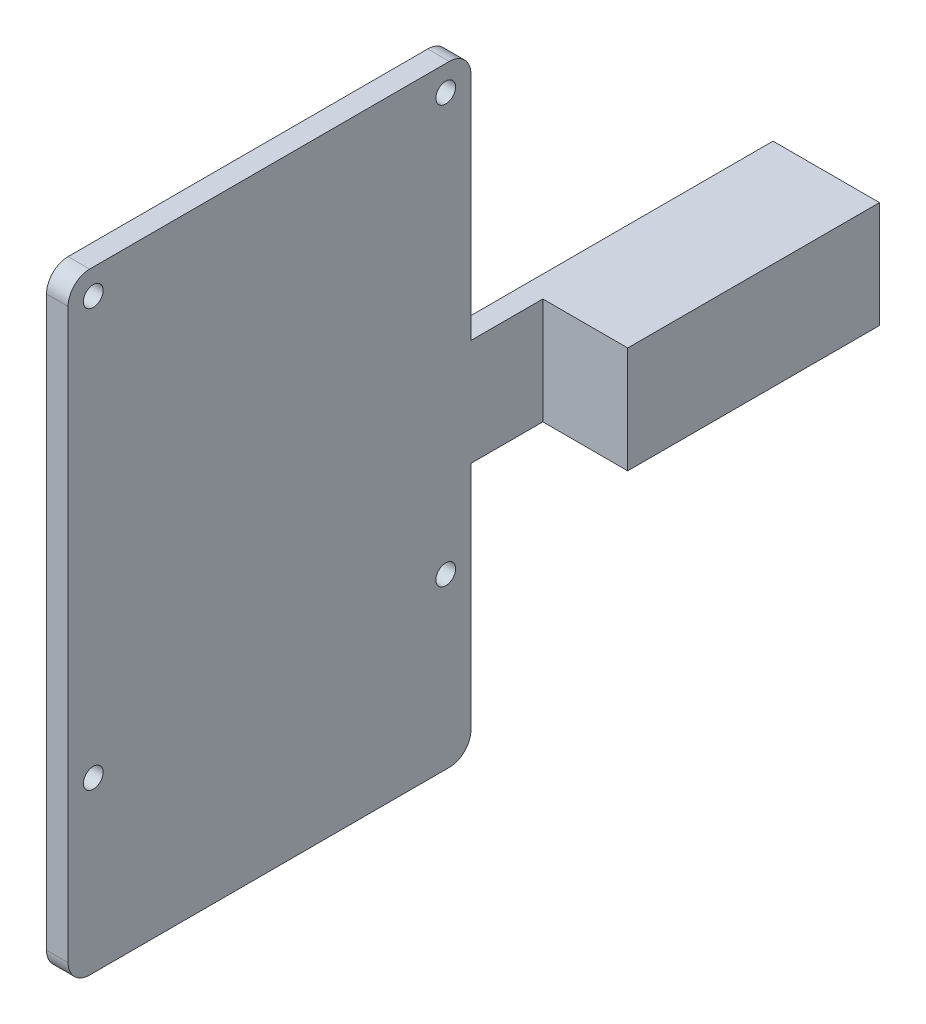
ISO-10303-21;
HEADER;
FILE_DESCRIPTION(('STEP AP214'),'2;1');
FILE_NAME('part.step','',(''),(''),'','','');
FILE_SCHEMA(('AUTOMOTIVE_DESIGN { 1 0 10303 214 1 1 1 1 }'));
ENDSEC;
DATA;
#1=APPLICATION_CONTEXT('core data for automotive mechanical design processes');
#2=APPLICATION_PROTOCOL_DEFINITION('international standard','automotive_design',2000,#1);
#3=PRODUCT_CONTEXT('',#1,'mechanical');
#4=PRODUCT('Part','Part','',(#3));
#5=PRODUCT_RELATED_PRODUCT_CATEGORY('part','',(#4));
#6=PRODUCT_DEFINITION_FORMATION('','',#4);
#7=PRODUCT_DEFINITION_CONTEXT('part definition',#1,'design');
#8=PRODUCT_DEFINITION('design','',#6,#7);
#9=PRODUCT_DEFINITION_SHAPE('','',#8);
#10=(LENGTH_UNIT() NAMED_UNIT(*) SI_UNIT(.MILLI.,.METRE.));
#11=(NAMED_UNIT(*) PLANE_ANGLE_UNIT() SI_UNIT($,.RADIAN.));
#12=(NAMED_UNIT(*) SI_UNIT($,.STERADIAN.) SOLID_ANGLE_UNIT());
#13=UNCERTAINTY_MEASURE_WITH_UNIT(LENGTH_MEASURE(1.E-05),#10,'distance_accuracy_value','');
#14=(GEOMETRIC_REPRESENTATION_CONTEXT(3) GLOBAL_UNCERTAINTY_ASSIGNED_CONTEXT((#13)) GLOBAL_UNIT_ASSIGNED_CONTEXT((#10,
#11,#12)) REPRESENTATION_CONTEXT('',''));
#15=CARTESIAN_POINT('',(0.,0.,0.));
#16=DIRECTION('',(0.,0.,1.));
#17=DIRECTION('',(1.,0.,0.));
#18=AXIS2_PLACEMENT_3D('',#15,#16,#17);
#19=CARTESIAN_POINT('',(-7.4,-7.4,35.));
#20=DIRECTION('',(1.,0.,0.));
#21=DIRECTION('',(0.,0.,-1.));
#22=AXIS2_PLACEMENT_3D('',#19,#20,#21);
#23=PLANE('',#22);
#24=CARTESIAN_POINT('',(-7.4,-19.,97.5));
#25=DIRECTION('',(1.,0.,0.));
#26=DIRECTION('',(0.,0.,-1.));
#27=AXIS2_PLACEMENT_3D('',#24,#25,#26);
#28=CIRCLE('',#27,1.375);
#29=CARTESIAN_POINT('',(-7.4,-19.,96.125));
#30=VERTEX_POINT('',#29);
#31=EDGE_CURVE('E340',#30,#30,#28,.T.);
#32=ORIENTED_EDGE('',*,*,#31,.T.);
#33=EDGE_LOOP('',(#32));
#34=FACE_BOUND('',#33,.T.);
#35=CARTESIAN_POINT('',(-7.4,-19.,48.5));
#36=DIRECTION('',(1.,0.,0.));
#37=DIRECTION('',(0.,0.,-1.));
#38=AXIS2_PLACEMENT_3D('',#35,#36,#37);
#39=CIRCLE('',#38,1.375);
#40=CARTESIAN_POINT('',(-7.4,-19.,47.125));
#41=VERTEX_POINT('',#40);
#42=EDGE_CURVE('E341',#41,#41,#39,.T.);
#43=ORIENTED_EDGE('',*,*,#42,.T.);
#44=EDGE_LOOP('',(#43));
#45=FACE_BOUND('',#44,.T.);
#46=CARTESIAN_POINT('',(-7.4,39.,48.5));
#47=DIRECTION('',(1.,0.,0.));
#48=DIRECTION('',(0.,0.,-1.));
#49=AXIS2_PLACEMENT_3D('',#46,#47,#48);
#50=CIRCLE('',#49,1.375);
#51=CARTESIAN_POINT('',(-7.4,39.,47.125));
#52=VERTEX_POINT('',#51);
#53=EDGE_CURVE('E346',#52,#52,#50,.T.);
#54=ORIENTED_EDGE('',*,*,#53,.T.);
#55=EDGE_LOOP('',(#54));
#56=FACE_BOUND('',#55,.T.);
#57=CARTESIAN_POINT('',(-7.4,39.,97.5));
#58=DIRECTION('',(1.,0.,0.));
#59=DIRECTION('',(0.,0.,-1.));
#60=AXIS2_PLACEMENT_3D('',#57,#58,#59);
#61=CIRCLE('',#60,1.375);
#62=CARTESIAN_POINT('',(-7.4,39.,96.125));
#63=VERTEX_POINT('',#62);
#64=EDGE_CURVE('E349',#63,#63,#61,.T.);
#65=ORIENTED_EDGE('',*,*,#64,.T.);
#66=EDGE_LOOP('',(#65));
#67=FACE_BOUND('',#66,.T.);
#68=DIRECTION('',(0.,-1.,0.));
#69=VECTOR('',#68,1.);
#70=CARTESIAN_POINT('',(-7.4,-42.5,45.));
#71=LINE('',#70,#69);
#72=CARTESIAN_POINT('',(-7.4,-7.4,45.));
#73=VERTEX_POINT('',#72);
#74=CARTESIAN_POINT('',(-7.4,-39.5,45.));
#75=VERTEX_POINT('',#74);
#76=EDGE_CURVE('E140',#73,#75,#71,.T.);
#77=ORIENTED_EDGE('',*,*,#76,.T.);
#78=CARTESIAN_POINT('',(-7.4,-39.5,48.));
#79=DIRECTION('',(1.,0.,0.));
#80=DIRECTION('',(0.,0.,-1.));
#81=AXIS2_PLACEMENT_3D('',#78,#79,#80);
#82=CIRCLE('',#81,3.);
#83=CARTESIAN_POINT('',(-7.4,-42.5,48.));
#84=VERTEX_POINT('',#83);
#85=EDGE_CURVE('E210',#75,#84,#82,.F.);
#86=ORIENTED_EDGE('',*,*,#85,.T.);
#87=DIRECTION('',(0.,0.,-1.));
#88=VECTOR('',#87,1.);
#89=CARTESIAN_POINT('',(-7.4,-42.5,101.));
#90=LINE('',#89,#88);
#91=CARTESIAN_POINT('',(-7.4,-42.5,98.));
#92=VERTEX_POINT('',#91);
#93=EDGE_CURVE('E167',#92,#84,#90,.T.);
#94=ORIENTED_EDGE('',*,*,#93,.F.);
#95=CARTESIAN_POINT('',(-7.4,-39.5,98.));
#96=DIRECTION('',(1.,0.,0.));
#97=DIRECTION('',(0.,0.,-1.));
#98=AXIS2_PLACEMENT_3D('',#95,#96,#97);
#99=CIRCLE('',#98,3.);
#100=CARTESIAN_POINT('',(-7.4,-39.5,101.));
#101=VERTEX_POINT('',#100);
#102=EDGE_CURVE('E208',#92,#101,#99,.F.);
#103=ORIENTED_EDGE('',*,*,#102,.T.);
#104=DIRECTION('',(0.,-1.,0.));
#105=VECTOR('',#104,1.);
#106=CARTESIAN_POINT('',(-7.4,-42.5,101.));
#107=LINE('',#106,#105);
#108=CARTESIAN_POINT('',(-7.40000000000001,39.5,101.));
#109=VERTEX_POINT('',#108);
#110=EDGE_CURVE('E234',#109,#101,#107,.T.);
#111=ORIENTED_EDGE('',*,*,#110,.F.);
#112=CARTESIAN_POINT('',(-7.4,39.5,98.));
#113=DIRECTION('',(1.,0.,0.));
#114=DIRECTION('',(0.,0.,-1.));
#115=AXIS2_PLACEMENT_3D('',#112,#113,#114);
#116=CIRCLE('',#115,3.);
#117=CARTESIAN_POINT('',(-7.40000000000001,42.5,98.));
#118=VERTEX_POINT('',#117);
#119=EDGE_CURVE('E205',#109,#118,#116,.F.);
#120=ORIENTED_EDGE('',*,*,#119,.T.);
#121=DIRECTION('',(0.,0.,-1.));
#122=VECTOR('',#121,1.);
#123=CARTESIAN_POINT('',(-7.40000000000001,42.5,101.));
#124=LINE('',#123,#122);
#125=CARTESIAN_POINT('',(-7.40000000000001,42.5,48.));
#126=VERTEX_POINT('',#125);
#127=EDGE_CURVE('E223',#118,#126,#124,.T.);
#128=ORIENTED_EDGE('',*,*,#127,.T.);
#129=CARTESIAN_POINT('',(-7.4,39.5,48.));
#130=DIRECTION('',(1.,0.,0.));
#131=DIRECTION('',(0.,0.,-1.));
#132=AXIS2_PLACEMENT_3D('',#129,#130,#131);
#133=CIRCLE('',#132,3.);
#134=CARTESIAN_POINT('',(-7.40000000000001,39.5,45.));
#135=VERTEX_POINT('',#134);
#136=EDGE_CURVE('E48',#126,#135,#133,.F.);
#137=ORIENTED_EDGE('',*,*,#136,.T.);
#138=CARTESIAN_POINT('',(-7.40000000000001,7.4,45.));
#139=VERTEX_POINT('',#138);
#140=EDGE_CURVE('E131',#135,#139,#71,.T.);
#141=ORIENTED_EDGE('',*,*,#140,.T.);
#142=DIRECTION('',(0.,0.,-1.));
#143=VECTOR('',#142,1.);
#144=CARTESIAN_POINT('',(-7.4,7.4,35.));
#145=LINE('',#144,#143);
#146=CARTESIAN_POINT('',(-7.4,7.4,0.));
#147=VERTEX_POINT('',#146);
#148=EDGE_CURVE('E135',#139,#147,#145,.T.);
#149=ORIENTED_EDGE('',*,*,#148,.T.);
#150=DIRECTION('',(0.,-1.,0.));
#151=VECTOR('',#150,1.);
#152=CARTESIAN_POINT('',(-7.4,-7.4,0.));
#153=LINE('',#152,#151);
#154=CARTESIAN_POINT('',(-7.4,-7.4,0.));
#155=VERTEX_POINT('',#154);
#156=EDGE_CURVE('E171',#147,#155,#153,.T.);
#157=ORIENTED_EDGE('',*,*,#156,.T.);
#158=DIRECTION('',(0.,0.,-1.));
#159=VECTOR('',#158,1.);
#160=CARTESIAN_POINT('',(-7.4,-7.4,35.));
#161=LINE('',#160,#159);
#162=EDGE_CURVE('E187',#73,#155,#161,.T.);
#163=ORIENTED_EDGE('',*,*,#162,.F.);
#164=EDGE_LOOP('',(#77,#86,#94,#103,#111,#120,#128,#137,#141,#149,#157,#163));
#165=FACE_BOUND('',#164,.T.);
#166=ADVANCED_FACE('F33',(#34,#45,#56,#67,#165),#23,.F.);
#167=CARTESIAN_POINT('',(7.4,-7.4,35.));
#168=DIRECTION('',(0.,1.,0.));
#169=DIRECTION('',(-1.,0.,0.));
#170=AXIS2_PLACEMENT_3D('',#167,#168,#169);
#171=PLANE('',#170);
#172=DIRECTION('',(1.,0.,0.));
#173=VECTOR('',#172,1.);
#174=CARTESIAN_POINT('',(7.4,-7.4,0.));
#175=LINE('',#174,#173);
#176=CARTESIAN_POINT('',(7.4,-7.4,0.));
#177=VERTEX_POINT('',#176);
#178=EDGE_CURVE('E178',#155,#177,#175,.T.);
#179=ORIENTED_EDGE('',*,*,#178,.T.);
#180=DIRECTION('',(0.,0.,-1.));
#181=VECTOR('',#180,1.);
#182=CARTESIAN_POINT('',(7.4,-7.4,35.));
#183=LINE('',#182,#181);
#184=CARTESIAN_POINT('',(7.4,-7.4,35.));
#185=VERTEX_POINT('',#184);
#186=EDGE_CURVE('E184',#185,#177,#183,.T.);
#187=ORIENTED_EDGE('',*,*,#186,.F.);
#188=DIRECTION('',(1.,0.,0.));
#189=VECTOR('',#188,1.);
#190=CARTESIAN_POINT('',(7.4,-7.4,35.));
#191=LINE('',#190,#189);
#192=CARTESIAN_POINT('',(-4.4,-7.4,35.));
#193=VERTEX_POINT('',#192);
#194=EDGE_CURVE('E172',#193,#185,#191,.T.);
#195=ORIENTED_EDGE('',*,*,#194,.F.);
#196=DIRECTION('',(0.,0.,-1.));
#197=VECTOR('',#196,1.);
#198=CARTESIAN_POINT('',(-4.4,-7.4,45.));
#199=LINE('',#198,#197);
#200=CARTESIAN_POINT('',(-4.4,-7.4,45.));
#201=VERTEX_POINT('',#200);
#202=EDGE_CURVE('E159',#201,#193,#199,.T.);
#203=ORIENTED_EDGE('',*,*,#202,.F.);
#204=DIRECTION('',(1.,0.,0.));
#205=VECTOR('',#204,1.);
#206=CARTESIAN_POINT('',(-7.4,-7.4,45.));
#207=LINE('',#206,#205);
#208=EDGE_CURVE('E157',#73,#201,#207,.T.);
#209=ORIENTED_EDGE('',*,*,#208,.F.);
#210=ORIENTED_EDGE('',*,*,#162,.T.);
#211=EDGE_LOOP('',(#179,#187,#195,#203,#209,#210));
#212=FACE_BOUND('',#211,.T.);
#213=ADVANCED_FACE('F273',(#212),#171,.F.);
#214=CARTESIAN_POINT('',(7.4,-7.4,35.));
#215=DIRECTION('',(-1.,0.,0.));
#216=DIRECTION('',(0.,0.,1.));
#217=AXIS2_PLACEMENT_3D('',#214,#215,#216);
#218=PLANE('',#217);
#219=DIRECTION('',(0.,1.,0.));
#220=VECTOR('',#219,1.);
#221=CARTESIAN_POINT('',(7.4,-7.4,0.));
#222=LINE('',#221,#220);
#223=CARTESIAN_POINT('',(7.4,7.4,0.));
#224=VERTEX_POINT('',#223);
#225=EDGE_CURVE('E180',#177,#224,#222,.T.);
#226=ORIENTED_EDGE('',*,*,#225,.T.);
#227=DIRECTION('',(0.,0.,-1.));
#228=VECTOR('',#227,1.);
#229=CARTESIAN_POINT('',(7.4,7.4,35.));
#230=LINE('',#229,#228);
#231=CARTESIAN_POINT('',(7.4,7.4,35.));
#232=VERTEX_POINT('',#231);
#233=EDGE_CURVE('E151',#232,#224,#230,.T.);
#234=ORIENTED_EDGE('',*,*,#233,.F.);
#235=DIRECTION('',(0.,1.,0.));
#236=VECTOR('',#235,1.);
#237=CARTESIAN_POINT('',(7.4,-7.4,35.));
#238=LINE('',#237,#236);
#239=EDGE_CURVE('E174',#185,#232,#238,.T.);
#240=ORIENTED_EDGE('',*,*,#239,.F.);
#241=ORIENTED_EDGE('',*,*,#186,.T.);
#242=EDGE_LOOP('',(#226,#234,#240,#241));
#243=FACE_BOUND('',#242,.T.);
#244=ADVANCED_FACE('F279',(#243),#218,.F.);
#245=CARTESIAN_POINT('',(7.4,7.4,35.));
#246=DIRECTION('',(0.,-1.,0.));
#247=DIRECTION('',(1.,0.,0.));
#248=AXIS2_PLACEMENT_3D('',#245,#246,#247);
#249=PLANE('',#248);
#250=DIRECTION('',(-1.,0.,0.));
#251=VECTOR('',#250,1.);
#252=CARTESIAN_POINT('',(7.4,7.4,0.));
#253=LINE('',#252,#251);
#254=EDGE_CURVE('E150',#224,#147,#253,.T.);
#255=ORIENTED_EDGE('',*,*,#254,.T.);
#256=ORIENTED_EDGE('',*,*,#148,.F.);
#257=DIRECTION('',(-1.,0.,0.));
#258=VECTOR('',#257,1.);
#259=CARTESIAN_POINT('',(-7.4,7.4,45.));
#260=LINE('',#259,#258);
#261=CARTESIAN_POINT('',(-4.4,7.4,45.));
#262=VERTEX_POINT('',#261);
#263=EDGE_CURVE('E146',#262,#139,#260,.T.);
#264=ORIENTED_EDGE('',*,*,#263,.F.);
#265=DIRECTION('',(0.,0.,-1.));
#266=VECTOR('',#265,1.);
#267=CARTESIAN_POINT('',(-4.4,7.4,45.));
#268=LINE('',#267,#266);
#269=CARTESIAN_POINT('',(-4.4,7.4,35.));
#270=VERTEX_POINT('',#269);
#271=EDGE_CURVE('E156',#262,#270,#268,.T.);
#272=ORIENTED_EDGE('',*,*,#271,.T.);
#273=DIRECTION('',(-1.,0.,0.));
#274=VECTOR('',#273,1.);
#275=CARTESIAN_POINT('',(7.4,7.4,35.));
#276=LINE('',#275,#274);
#277=EDGE_CURVE('E152',#232,#270,#276,.T.);
#278=ORIENTED_EDGE('',*,*,#277,.F.);
#279=ORIENTED_EDGE('',*,*,#233,.T.);
#280=EDGE_LOOP('',(#255,#256,#264,#272,#278,#279));
#281=FACE_BOUND('',#280,.T.);
#282=ADVANCED_FACE('F144',(#281),#249,.F.);
#283=CARTESIAN_POINT('',(0.,0.,35.));
#284=DIRECTION('',(0.,0.,1.));
#285=DIRECTION('',(1.,0.,0.));
#286=AXIS2_PLACEMENT_3D('',#283,#284,#285);
#287=PLANE('',#286);
#288=DIRECTION('',(0.,1.,0.));
#289=VECTOR('',#288,1.);
#290=CARTESIAN_POINT('',(-4.4,7.4,35.));
#291=LINE('',#290,#289);
#292=EDGE_CURVE('E162',#193,#270,#291,.T.);
#293=ORIENTED_EDGE('',*,*,#292,.F.);
#294=ORIENTED_EDGE('',*,*,#194,.T.);
#295=ORIENTED_EDGE('',*,*,#239,.T.);
#296=ORIENTED_EDGE('',*,*,#277,.T.);
#297=EDGE_LOOP('',(#293,#294,#295,#296));
#298=FACE_BOUND('',#297,.T.);
#299=ADVANCED_FACE('F322',(#298),#287,.T.);
#300=CARTESIAN_POINT('',(0.,0.,0.));
#301=DIRECTION('',(0.,0.,1.));
#302=DIRECTION('',(1.,0.,0.));
#303=AXIS2_PLACEMENT_3D('',#300,#301,#302);
#304=PLANE('',#303);
#305=ORIENTED_EDGE('',*,*,#156,.F.);
#306=ORIENTED_EDGE('',*,*,#254,.F.);
#307=ORIENTED_EDGE('',*,*,#225,.F.);
#308=ORIENTED_EDGE('',*,*,#178,.F.);
#309=EDGE_LOOP('',(#305,#306,#307,#308));
#310=FACE_BOUND('',#309,.T.);
#311=ADVANCED_FACE('F320',(#310),#304,.F.);
#312=CARTESIAN_POINT('',(-4.4,7.4,45.));
#313=DIRECTION('',(-1.,0.,0.));
#314=DIRECTION('',(0.,-1.,0.));
#315=AXIS2_PLACEMENT_3D('',#312,#313,#314);
#316=PLANE('',#315);
#317=CARTESIAN_POINT('',(-4.4,-19.,97.5));
#318=DIRECTION('',(1.,0.,0.));
#319=DIRECTION('',(0.,1.,0.));
#320=AXIS2_PLACEMENT_3D('',#317,#318,#319);
#321=CIRCLE('',#320,1.375);
#322=CARTESIAN_POINT('',(-4.4,-17.625,97.5));
#323=VERTEX_POINT('',#322);
#324=EDGE_CURVE('E356',#323,#323,#321,.T.);
#325=ORIENTED_EDGE('',*,*,#324,.F.);
#326=EDGE_LOOP('',(#325));
#327=FACE_BOUND('',#326,.T.);
#328=CARTESIAN_POINT('',(-4.4,-19.,48.5));
#329=DIRECTION('',(1.,0.,0.));
#330=DIRECTION('',(0.,1.,0.));
#331=AXIS2_PLACEMENT_3D('',#328,#329,#330);
#332=CIRCLE('',#331,1.375);
#333=CARTESIAN_POINT('',(-4.4,-17.625,48.5));
#334=VERTEX_POINT('',#333);
#335=EDGE_CURVE('E358',#334,#334,#332,.T.);
#336=ORIENTED_EDGE('',*,*,#335,.F.);
#337=EDGE_LOOP('',(#336));
#338=FACE_BOUND('',#337,.T.);
#339=CARTESIAN_POINT('',(-4.4,39.,48.5));
#340=DIRECTION('',(1.,0.,0.));
#341=DIRECTION('',(0.,1.,0.));
#342=AXIS2_PLACEMENT_3D('',#339,#340,#341);
#343=CIRCLE('',#342,1.375);
#344=CARTESIAN_POINT('',(-4.4,40.375,48.5));
#345=VERTEX_POINT('',#344);
#346=EDGE_CURVE('E355',#345,#345,#343,.T.);
#347=ORIENTED_EDGE('',*,*,#346,.F.);
#348=EDGE_LOOP('',(#347));
#349=FACE_BOUND('',#348,.T.);
#350=CARTESIAN_POINT('',(-4.4,39.,97.5));
#351=DIRECTION('',(1.,0.,0.));
#352=DIRECTION('',(0.,1.,0.));
#353=AXIS2_PLACEMENT_3D('',#350,#351,#352);
#354=CIRCLE('',#353,1.375);
#355=CARTESIAN_POINT('',(-4.4,40.375,97.5));
#356=VERTEX_POINT('',#355);
#357=EDGE_CURVE('E352',#356,#356,#354,.T.);
#358=ORIENTED_EDGE('',*,*,#357,.F.);
#359=EDGE_LOOP('',(#358));
#360=FACE_BOUND('',#359,.T.);
#361=DIRECTION('',(0.,0.,-1.));
#362=VECTOR('',#361,1.);
#363=CARTESIAN_POINT('',(-4.4,-42.5,101.));
#364=LINE('',#363,#362);
#365=CARTESIAN_POINT('',(-4.4,-42.5,98.));
#366=VERTEX_POINT('',#365);
#367=CARTESIAN_POINT('',(-4.4,-42.5,48.));
#368=VERTEX_POINT('',#367);
#369=EDGE_CURVE('E231',#366,#368,#364,.T.);
#370=ORIENTED_EDGE('',*,*,#369,.T.);
#371=CARTESIAN_POINT('',(-4.4,-39.5,48.));
#372=DIRECTION('',(-1.,0.,0.));
#373=DIRECTION('',(0.,-1.,0.));
#374=AXIS2_PLACEMENT_3D('',#371,#372,#373);
#375=CIRCLE('',#374,3.);
#376=CARTESIAN_POINT('',(-4.4,-39.5,45.));
#377=VERTEX_POINT('',#376);
#378=EDGE_CURVE('E201',#368,#377,#375,.F.);
#379=ORIENTED_EDGE('',*,*,#378,.T.);
#380=DIRECTION('',(0.,1.,0.));
#381=VECTOR('',#380,1.);
#382=CARTESIAN_POINT('',(-4.4,-42.5,45.));
#383=LINE('',#382,#381);
#384=EDGE_CURVE('E237',#377,#201,#383,.T.);
#385=ORIENTED_EDGE('',*,*,#384,.T.);
#386=ORIENTED_EDGE('',*,*,#202,.T.);
#387=ORIENTED_EDGE('',*,*,#292,.T.);
#388=ORIENTED_EDGE('',*,*,#271,.F.);
#389=CARTESIAN_POINT('',(-4.40000000000001,39.5,45.));
#390=VERTEX_POINT('',#389);
#391=EDGE_CURVE('E139',#262,#390,#383,.T.);
#392=ORIENTED_EDGE('',*,*,#391,.T.);
#393=CARTESIAN_POINT('',(-4.4,39.5,48.));
#394=DIRECTION('',(-1.,0.,0.));
#395=DIRECTION('',(0.,-1.,0.));
#396=AXIS2_PLACEMENT_3D('',#393,#394,#395);
#397=CIRCLE('',#396,3.);
#398=CARTESIAN_POINT('',(-4.40000000000001,42.5,48.));
#399=VERTEX_POINT('',#398);
#400=EDGE_CURVE('E197',#390,#399,#397,.F.);
#401=ORIENTED_EDGE('',*,*,#400,.T.);
#402=DIRECTION('',(0.,0.,-1.));
#403=VECTOR('',#402,1.);
#404=CARTESIAN_POINT('',(-4.40000000000001,42.5,101.));
#405=LINE('',#404,#403);
#406=CARTESIAN_POINT('',(-4.40000000000001,42.5,98.));
#407=VERTEX_POINT('',#406);
#408=EDGE_CURVE('E226',#407,#399,#405,.T.);
#409=ORIENTED_EDGE('',*,*,#408,.F.);
#410=CARTESIAN_POINT('',(-4.4,39.5,98.));
#411=DIRECTION('',(-1.,0.,0.));
#412=DIRECTION('',(0.,-1.,0.));
#413=AXIS2_PLACEMENT_3D('',#410,#411,#412);
#414=CIRCLE('',#413,3.);
#415=CARTESIAN_POINT('',(-4.40000000000001,39.5,101.));
#416=VERTEX_POINT('',#415);
#417=EDGE_CURVE('E195',#407,#416,#414,.F.);
#418=ORIENTED_EDGE('',*,*,#417,.T.);
#419=DIRECTION('',(0.,1.,0.));
#420=VECTOR('',#419,1.);
#421=CARTESIAN_POINT('',(-4.4,-42.5,101.));
#422=LINE('',#421,#420);
#423=CARTESIAN_POINT('',(-4.4,-39.5,101.));
#424=VERTEX_POINT('',#423);
#425=EDGE_CURVE('E229',#424,#416,#422,.T.);
#426=ORIENTED_EDGE('',*,*,#425,.F.);
#427=CARTESIAN_POINT('',(-4.4,-39.5,98.));
#428=DIRECTION('',(-1.,0.,0.));
#429=DIRECTION('',(0.,-1.,0.));
#430=AXIS2_PLACEMENT_3D('',#427,#428,#429);
#431=CIRCLE('',#430,3.);
#432=EDGE_CURVE('E199',#424,#366,#431,.F.);
#433=ORIENTED_EDGE('',*,*,#432,.T.);
#434=EDGE_LOOP('',(#370,#379,#385,#386,#387,#388,#392,#401,#409,#418,#426,#433));
#435=FACE_BOUND('',#434,.T.);
#436=ADVANCED_FACE('F254',(#327,#338,#349,#360,#435),#316,.F.);
#437=CARTESIAN_POINT('',(0.,0.,45.));
#438=DIRECTION('',(0.,0.,-1.));
#439=DIRECTION('',(-1.,0.,0.));
#440=AXIS2_PLACEMENT_3D('',#437,#438,#439);
#441=PLANE('',#440);
#442=ORIENTED_EDGE('',*,*,#384,.F.);
#443=DIRECTION('',(1.,0.,0.));
#444=VECTOR('',#443,1.);
#445=CARTESIAN_POINT('',(-7.4,-39.5,45.));
#446=LINE('',#445,#444);
#447=EDGE_CURVE('E203',#377,#75,#446,.F.);
#448=ORIENTED_EDGE('',*,*,#447,.T.);
#449=ORIENTED_EDGE('',*,*,#76,.F.);
#450=ORIENTED_EDGE('',*,*,#208,.T.);
#451=EDGE_LOOP('',(#442,#448,#449,#450));
#452=FACE_BOUND('',#451,.T.);
#453=ADVANCED_FACE('F257',(#452),#441,.T.);
#454=CARTESIAN_POINT('',(-7.4,-42.5,101.));
#455=DIRECTION('',(0.,1.,0.));
#456=DIRECTION('',(0.,0.,1.));
#457=AXIS2_PLACEMENT_3D('',#454,#455,#456);
#458=PLANE('',#457);
#459=ORIENTED_EDGE('',*,*,#93,.T.);
#460=DIRECTION('',(1.,0.,0.));
#461=VECTOR('',#460,1.);
#462=CARTESIAN_POINT('',(-4.4,-42.5,48.));
#463=LINE('',#462,#461);
#464=EDGE_CURVE('E192',#84,#368,#463,.T.);
#465=ORIENTED_EDGE('',*,*,#464,.T.);
#466=ORIENTED_EDGE('',*,*,#369,.F.);
#467=DIRECTION('',(1.,0.,0.));
#468=VECTOR('',#467,1.);
#469=CARTESIAN_POINT('',(-7.4,-42.5,98.));
#470=LINE('',#469,#468);
#471=EDGE_CURVE('E190',#366,#92,#470,.F.);
#472=ORIENTED_EDGE('',*,*,#471,.T.);
#473=EDGE_LOOP('',(#459,#465,#466,#472));
#474=FACE_BOUND('',#473,.T.);
#475=ADVANCED_FACE('F244',(#474),#458,.F.);
#476=CARTESIAN_POINT('',(-7.40000000000001,42.5,101.));
#477=DIRECTION('',(0.,-1.,0.));
#478=DIRECTION('',(0.,0.,-1.));
#479=AXIS2_PLACEMENT_3D('',#476,#477,#478);
#480=PLANE('',#479);
#481=ORIENTED_EDGE('',*,*,#408,.T.);
#482=DIRECTION('',(-1.,0.,0.));
#483=VECTOR('',#482,1.);
#484=CARTESIAN_POINT('',(-7.40000000000001,42.5,48.));
#485=LINE('',#484,#483);
#486=EDGE_CURVE('E41',#399,#126,#485,.T.);
#487=ORIENTED_EDGE('',*,*,#486,.T.);
#488=ORIENTED_EDGE('',*,*,#127,.F.);
#489=DIRECTION('',(-1.,0.,0.));
#490=VECTOR('',#489,1.);
#491=CARTESIAN_POINT('',(-7.40000000000001,42.5,98.));
#492=LINE('',#491,#490);
#493=EDGE_CURVE('E218',#118,#407,#492,.F.);
#494=ORIENTED_EDGE('',*,*,#493,.T.);
#495=EDGE_LOOP('',(#481,#487,#488,#494));
#496=FACE_BOUND('',#495,.T.);
#497=ADVANCED_FACE('F222',(#496),#480,.F.);
#498=CARTESIAN_POINT('',(0.,0.,101.));
#499=DIRECTION('',(0.,0.,-1.));
#500=DIRECTION('',(-1.,0.,0.));
#501=AXIS2_PLACEMENT_3D('',#498,#499,#500);
#502=PLANE('',#501);
#503=ORIENTED_EDGE('',*,*,#110,.T.);
#504=DIRECTION('',(1.,0.,0.));
#505=VECTOR('',#504,1.);
#506=CARTESIAN_POINT('',(0.,-39.5,101.));
#507=LINE('',#506,#505);
#508=EDGE_CURVE('E215',#101,#424,#507,.T.);
#509=ORIENTED_EDGE('',*,*,#508,.T.);
#510=ORIENTED_EDGE('',*,*,#425,.T.);
#511=DIRECTION('',(-1.,0.,0.));
#512=VECTOR('',#511,1.);
#513=CARTESIAN_POINT('',(0.,39.5,101.));
#514=LINE('',#513,#512);
#515=EDGE_CURVE('E212',#416,#109,#514,.T.);
#516=ORIENTED_EDGE('',*,*,#515,.T.);
#517=EDGE_LOOP('',(#503,#509,#510,#516));
#518=FACE_BOUND('',#517,.T.);
#519=ADVANCED_FACE('F308',(#518),#502,.F.);
#520=ORIENTED_EDGE('',*,*,#140,.F.);
#521=DIRECTION('',(-1.,0.,0.));
#522=VECTOR('',#521,1.);
#523=CARTESIAN_POINT('',(-4.40000000000001,39.5,45.));
#524=LINE('',#523,#522);
#525=EDGE_CURVE('E11',#135,#390,#524,.F.);
#526=ORIENTED_EDGE('',*,*,#525,.T.);
#527=ORIENTED_EDGE('',*,*,#391,.F.);
#528=ORIENTED_EDGE('',*,*,#263,.T.);
#529=EDGE_LOOP('',(#520,#526,#527,#528));
#530=FACE_BOUND('',#529,.T.);
#531=ADVANCED_FACE('F154',(#530),#441,.T.);
#532=CARTESIAN_POINT('',(-9.40000000000001,39.,97.5));
#533=DIRECTION('',(1.,0.,0.));
#534=DIRECTION('',(0.,1.,0.));
#535=AXIS2_PLACEMENT_3D('',#532,#533,#534);
#536=CYLINDRICAL_SURFACE('',#535,1.375);
#537=ORIENTED_EDGE('',*,*,#357,.T.);
#538=EDGE_LOOP('',(#537));
#539=FACE_BOUND('',#538,.T.);
#540=ORIENTED_EDGE('',*,*,#64,.F.);
#541=EDGE_LOOP('',(#540));
#542=FACE_BOUND('',#541,.T.);
#543=ADVANCED_FACE('F304',(#539,#542),#536,.F.);
#544=CARTESIAN_POINT('',(-9.40000000000001,39.,48.5));
#545=DIRECTION('',(1.,0.,0.));
#546=DIRECTION('',(0.,1.,0.));
#547=AXIS2_PLACEMENT_3D('',#544,#545,#546);
#548=CYLINDRICAL_SURFACE('',#547,1.375);
#549=ORIENTED_EDGE('',*,*,#346,.T.);
#550=EDGE_LOOP('',(#549));
#551=FACE_BOUND('',#550,.T.);
#552=ORIENTED_EDGE('',*,*,#53,.F.);
#553=EDGE_LOOP('',(#552));
#554=FACE_BOUND('',#553,.T.);
#555=ADVANCED_FACE('F297',(#551,#554),#548,.F.);
#556=CARTESIAN_POINT('',(-9.4,-19.,48.5));
#557=DIRECTION('',(1.,0.,0.));
#558=DIRECTION('',(0.,1.,0.));
#559=AXIS2_PLACEMENT_3D('',#556,#557,#558);
#560=CYLINDRICAL_SURFACE('',#559,1.375);
#561=ORIENTED_EDGE('',*,*,#335,.T.);
#562=EDGE_LOOP('',(#561));
#563=FACE_BOUND('',#562,.T.);
#564=ORIENTED_EDGE('',*,*,#42,.F.);
#565=EDGE_LOOP('',(#564));
#566=FACE_BOUND('',#565,.T.);
#567=ADVANCED_FACE('F291',(#563,#566),#560,.F.);
#568=CARTESIAN_POINT('',(-9.4,-19.,97.5));
#569=DIRECTION('',(1.,0.,0.));
#570=DIRECTION('',(0.,1.,0.));
#571=AXIS2_PLACEMENT_3D('',#568,#569,#570);
#572=CYLINDRICAL_SURFACE('',#571,1.375);
#573=ORIENTED_EDGE('',*,*,#324,.T.);
#574=EDGE_LOOP('',(#573));
#575=FACE_BOUND('',#574,.T.);
#576=ORIENTED_EDGE('',*,*,#31,.F.);
#577=EDGE_LOOP('',(#576));
#578=FACE_BOUND('',#577,.T.);
#579=ADVANCED_FACE('F287',(#575,#578),#572,.F.);
#580=CARTESIAN_POINT('',(-7.4,-39.5,48.));
#581=DIRECTION('',(-1.,0.,0.));
#582=DIRECTION('',(0.,0.,1.));
#583=AXIS2_PLACEMENT_3D('',#580,#581,#582);
#584=CYLINDRICAL_SURFACE('',#583,3.);
#585=ORIENTED_EDGE('',*,*,#85,.F.);
#586=ORIENTED_EDGE('',*,*,#447,.F.);
#587=ORIENTED_EDGE('',*,*,#378,.F.);
#588=ORIENTED_EDGE('',*,*,#464,.F.);
#589=EDGE_LOOP('',(#585,#586,#587,#588));
#590=FACE_BOUND('',#589,.T.);
#591=ADVANCED_FACE('F250',(#590),#584,.T.);
#592=CARTESIAN_POINT('',(0.,-39.5,98.));
#593=DIRECTION('',(1.,0.,0.));
#594=DIRECTION('',(0.,0.,-1.));
#595=AXIS2_PLACEMENT_3D('',#592,#593,#594);
#596=CYLINDRICAL_SURFACE('',#595,3.);
#597=ORIENTED_EDGE('',*,*,#102,.F.);
#598=ORIENTED_EDGE('',*,*,#471,.F.);
#599=ORIENTED_EDGE('',*,*,#432,.F.);
#600=ORIENTED_EDGE('',*,*,#508,.F.);
#601=EDGE_LOOP('',(#597,#598,#599,#600));
#602=FACE_BOUND('',#601,.T.);
#603=ADVANCED_FACE('F264',(#602),#596,.T.);
#604=CARTESIAN_POINT('',(-7.40000000000001,39.5,48.));
#605=DIRECTION('',(1.,0.,0.));
#606=DIRECTION('',(0.,0.,-1.));
#607=AXIS2_PLACEMENT_3D('',#604,#605,#606);
#608=CYLINDRICAL_SURFACE('',#607,3.);
#609=ORIENTED_EDGE('',*,*,#400,.F.);
#610=ORIENTED_EDGE('',*,*,#525,.F.);
#611=ORIENTED_EDGE('',*,*,#136,.F.);
#612=ORIENTED_EDGE('',*,*,#486,.F.);
#613=EDGE_LOOP('',(#609,#610,#611,#612));
#614=FACE_BOUND('',#613,.T.);
#615=ADVANCED_FACE('F262',(#614),#608,.T.);
#616=CARTESIAN_POINT('',(0.,39.5,98.));
#617=DIRECTION('',(-1.,0.,0.));
#618=DIRECTION('',(0.,0.,1.));
#619=AXIS2_PLACEMENT_3D('',#616,#617,#618);
#620=CYLINDRICAL_SURFACE('',#619,3.);
#621=ORIENTED_EDGE('',*,*,#417,.F.);
#622=ORIENTED_EDGE('',*,*,#493,.F.);
#623=ORIENTED_EDGE('',*,*,#119,.F.);
#624=ORIENTED_EDGE('',*,*,#515,.F.);
#625=EDGE_LOOP('',(#621,#622,#623,#624));
#626=FACE_BOUND('',#625,.T.);
#627=ADVANCED_FACE('F35',(#626),#620,.T.);
#628=CLOSED_SHELL('',(#166,#213,#244,#282,#299,#311,#436,#453,#475,#497,#519,#531,#543,#555,
#567,#579,#591,#603,#615,#627));
#629=MANIFOLD_SOLID_BREP('B2',#628);
#630=ADVANCED_BREP_SHAPE_REPRESENTATION('',(#18,#629),#14);
#631=SHAPE_DEFINITION_REPRESENTATION(#9,#630);
ENDSEC;
END-ISO-10303-21;
